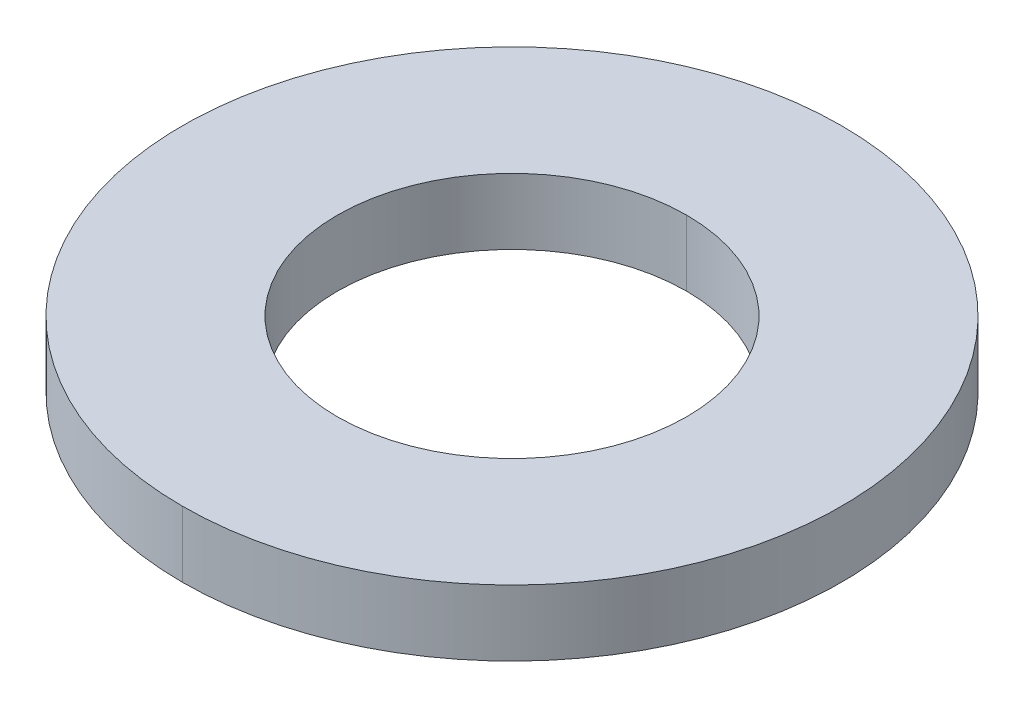
ISO-10303-21;
HEADER;
FILE_DESCRIPTION(('STEP AP214'),'2;1');
FILE_NAME('part.step','',(''),(''),'','','');
FILE_SCHEMA(('AUTOMOTIVE_DESIGN { 1 0 10303 214 1 1 1 1 }'));
ENDSEC;
DATA;
#1=APPLICATION_CONTEXT('core data for automotive mechanical design processes');
#2=APPLICATION_PROTOCOL_DEFINITION('international standard','automotive_design',2000,#1);
#3=PRODUCT_CONTEXT('',#1,'mechanical');
#4=PRODUCT('Part','Part','',(#3));
#5=PRODUCT_RELATED_PRODUCT_CATEGORY('part','',(#4));
#6=PRODUCT_DEFINITION_FORMATION('','',#4);
#7=PRODUCT_DEFINITION_CONTEXT('part definition',#1,'design');
#8=PRODUCT_DEFINITION('design','',#6,#7);
#9=PRODUCT_DEFINITION_SHAPE('','',#8);
#10=(LENGTH_UNIT() NAMED_UNIT(*) SI_UNIT(.MILLI.,.METRE.));
#11=(NAMED_UNIT(*) PLANE_ANGLE_UNIT() SI_UNIT($,.RADIAN.));
#12=(NAMED_UNIT(*) SI_UNIT($,.STERADIAN.) SOLID_ANGLE_UNIT());
#13=UNCERTAINTY_MEASURE_WITH_UNIT(LENGTH_MEASURE(1.E-05),#10,'distance_accuracy_value','');
#14=(GEOMETRIC_REPRESENTATION_CONTEXT(3) GLOBAL_UNCERTAINTY_ASSIGNED_CONTEXT((#13)) GLOBAL_UNIT_ASSIGNED_CONTEXT((#10,
#11,#12)) REPRESENTATION_CONTEXT('',''));
#15=CARTESIAN_POINT('',(0.,0.,0.));
#16=DIRECTION('',(0.,0.,1.));
#17=DIRECTION('',(1.,0.,0.));
#18=AXIS2_PLACEMENT_3D('',#15,#16,#17);
#19=CARTESIAN_POINT('',(0.,1.,0.));
#20=DIRECTION('',(0.,-1.,0.));
#21=DIRECTION('',(0.,0.,-1.));
#22=AXIS2_PLACEMENT_3D('',#19,#20,#21);
#23=CYLINDRICAL_SURFACE('',#22,2.65);
#24=DIRECTION('',(0.,-1.,0.));
#25=VECTOR('',#24,1.);
#26=CARTESIAN_POINT('',(0.,1.,2.65));
#27=LINE('',#26,#25);
#28=CARTESIAN_POINT('',(0.,1.,2.65));
#29=VERTEX_POINT('',#28);
#30=CARTESIAN_POINT('',(0.,0.,2.65));
#31=VERTEX_POINT('',#30);
#32=EDGE_CURVE('E125',#29,#31,#27,.T.);
#33=ORIENTED_EDGE('',*,*,#32,.F.);
#34=CARTESIAN_POINT('',(0.,1.,0.));
#35=DIRECTION('',(0.,1.,0.));
#36=DIRECTION('',(0.,0.,1.));
#37=AXIS2_PLACEMENT_3D('',#34,#35,#36);
#38=CIRCLE('',#37,2.65);
#39=CARTESIAN_POINT('',(0.,1.,-2.65));
#40=VERTEX_POINT('',#39);
#41=EDGE_CURVE('E76',#29,#40,#38,.T.);
#42=ORIENTED_EDGE('',*,*,#41,.T.);
#43=DIRECTION('',(0.,-1.,0.));
#44=VECTOR('',#43,1.);
#45=CARTESIAN_POINT('',(0.,1.,-2.65));
#46=LINE('',#45,#44);
#47=CARTESIAN_POINT('',(0.,0.,-2.65));
#48=VERTEX_POINT('',#47);
#49=EDGE_CURVE('E88',#40,#48,#46,.T.);
#50=ORIENTED_EDGE('',*,*,#49,.T.);
#51=CARTESIAN_POINT('',(0.,0.,0.));
#52=DIRECTION('',(0.,1.,0.));
#53=DIRECTION('',(0.,0.,1.));
#54=AXIS2_PLACEMENT_3D('',#51,#52,#53);
#55=CIRCLE('',#54,2.65);
#56=EDGE_CURVE('E11',#31,#48,#55,.T.);
#57=ORIENTED_EDGE('',*,*,#56,.F.);
#58=EDGE_LOOP('',(#33,#42,#50,#57));
#59=FACE_BOUND('',#58,.T.);
#60=ADVANCED_FACE('F17',(#59),#23,.F.);
#61=CARTESIAN_POINT('',(0.,1.,0.));
#62=DIRECTION('',(0.,-1.,0.));
#63=DIRECTION('',(0.,0.,-1.));
#64=AXIS2_PLACEMENT_3D('',#61,#62,#63);
#65=CYLINDRICAL_SURFACE('',#64,5.);
#66=DIRECTION('',(0.,-1.,0.));
#67=VECTOR('',#66,1.);
#68=CARTESIAN_POINT('',(0.,1.,5.));
#69=LINE('',#68,#67);
#70=CARTESIAN_POINT('',(0.,1.,5.));
#71=VERTEX_POINT('',#70);
#72=CARTESIAN_POINT('',(0.,0.,5.));
#73=VERTEX_POINT('',#72);
#74=EDGE_CURVE('E79',#71,#73,#69,.T.);
#75=ORIENTED_EDGE('',*,*,#74,.F.);
#76=CARTESIAN_POINT('',(0.,1.,0.));
#77=DIRECTION('',(0.,1.,0.));
#78=DIRECTION('',(0.,0.,1.));
#79=AXIS2_PLACEMENT_3D('',#76,#77,#78);
#80=CIRCLE('',#79,5.);
#81=CARTESIAN_POINT('',(0.,1.,-5.));
#82=VERTEX_POINT('',#81);
#83=EDGE_CURVE('E70',#82,#71,#80,.T.);
#84=ORIENTED_EDGE('',*,*,#83,.F.);
#85=DIRECTION('',(0.,-1.,0.));
#86=VECTOR('',#85,1.);
#87=CARTESIAN_POINT('',(0.,1.,-5.));
#88=LINE('',#87,#86);
#89=CARTESIAN_POINT('',(0.,0.,-5.));
#90=VERTEX_POINT('',#89);
#91=EDGE_CURVE('E77',#82,#90,#88,.T.);
#92=ORIENTED_EDGE('',*,*,#91,.T.);
#93=CARTESIAN_POINT('',(0.,0.,0.));
#94=DIRECTION('',(0.,1.,0.));
#95=DIRECTION('',(0.,0.,1.));
#96=AXIS2_PLACEMENT_3D('',#93,#94,#95);
#97=CIRCLE('',#96,5.);
#98=EDGE_CURVE('E25',#90,#73,#97,.T.);
#99=ORIENTED_EDGE('',*,*,#98,.T.);
#100=EDGE_LOOP('',(#75,#84,#92,#99));
#101=FACE_BOUND('',#100,.T.);
#102=ADVANCED_FACE('F80',(#101),#65,.T.);
#103=CARTESIAN_POINT('',(0.,0.,0.));
#104=DIRECTION('',(0.,1.,0.));
#105=DIRECTION('',(1.,0.,0.));
#106=AXIS2_PLACEMENT_3D('',#103,#104,#105);
#107=PLANE('',#106);
#108=CARTESIAN_POINT('',(0.,0.,0.));
#109=DIRECTION('',(0.,1.,0.));
#110=DIRECTION('',(0.,0.,1.));
#111=AXIS2_PLACEMENT_3D('',#108,#109,#110);
#112=CIRCLE('',#111,2.65);
#113=EDGE_CURVE('E95',#48,#31,#112,.T.);
#114=ORIENTED_EDGE('',*,*,#113,.T.);
#115=ORIENTED_EDGE('',*,*,#56,.T.);
#116=EDGE_LOOP('',(#114,#115));
#117=FACE_BOUND('',#116,.T.);
#118=ORIENTED_EDGE('',*,*,#98,.F.);
#119=CARTESIAN_POINT('',(0.,0.,0.));
#120=DIRECTION('',(0.,1.,0.));
#121=DIRECTION('',(0.,0.,1.));
#122=AXIS2_PLACEMENT_3D('',#119,#120,#121);
#123=CIRCLE('',#122,5.);
#124=EDGE_CURVE('E84',#73,#90,#123,.T.);
#125=ORIENTED_EDGE('',*,*,#124,.F.);
#126=EDGE_LOOP('',(#118,#125));
#127=FACE_BOUND('',#126,.T.);
#128=ADVANCED_FACE('F106',(#117,#127),#107,.F.);
#129=CARTESIAN_POINT('',(0.,1.,0.));
#130=DIRECTION('',(0.,1.,0.));
#131=DIRECTION('',(1.,0.,0.));
#132=AXIS2_PLACEMENT_3D('',#129,#130,#131);
#133=PLANE('',#132);
#134=CARTESIAN_POINT('',(0.,1.,0.));
#135=DIRECTION('',(0.,1.,0.));
#136=DIRECTION('',(0.,0.,1.));
#137=AXIS2_PLACEMENT_3D('',#134,#135,#136);
#138=CIRCLE('',#137,2.65);
#139=EDGE_CURVE('E131',#40,#29,#138,.T.);
#140=ORIENTED_EDGE('',*,*,#139,.F.);
#141=ORIENTED_EDGE('',*,*,#41,.F.);
#142=EDGE_LOOP('',(#140,#141));
#143=FACE_BOUND('',#142,.T.);
#144=ORIENTED_EDGE('',*,*,#83,.T.);
#145=CARTESIAN_POINT('',(0.,1.,0.));
#146=DIRECTION('',(0.,1.,0.));
#147=DIRECTION('',(0.,0.,1.));
#148=AXIS2_PLACEMENT_3D('',#145,#146,#147);
#149=CIRCLE('',#148,5.);
#150=EDGE_CURVE('E73',#71,#82,#149,.T.);
#151=ORIENTED_EDGE('',*,*,#150,.T.);
#152=EDGE_LOOP('',(#144,#151));
#153=FACE_BOUND('',#152,.T.);
#154=ADVANCED_FACE('F71',(#143,#153),#133,.T.);
#155=CARTESIAN_POINT('',(0.,1.,0.));
#156=DIRECTION('',(0.,-1.,0.));
#157=DIRECTION('',(0.,0.,-1.));
#158=AXIS2_PLACEMENT_3D('',#155,#156,#157);
#159=CYLINDRICAL_SURFACE('',#158,5.);
#160=ORIENTED_EDGE('',*,*,#150,.F.);
#161=ORIENTED_EDGE('',*,*,#74,.T.);
#162=ORIENTED_EDGE('',*,*,#124,.T.);
#163=ORIENTED_EDGE('',*,*,#91,.F.);
#164=EDGE_LOOP('',(#160,#161,#162,#163));
#165=FACE_BOUND('',#164,.T.);
#166=ADVANCED_FACE('F86',(#165),#159,.T.);
#167=CARTESIAN_POINT('',(0.,1.,0.));
#168=DIRECTION('',(0.,-1.,0.));
#169=DIRECTION('',(0.,0.,-1.));
#170=AXIS2_PLACEMENT_3D('',#167,#168,#169);
#171=CYLINDRICAL_SURFACE('',#170,2.65);
#172=ORIENTED_EDGE('',*,*,#139,.T.);
#173=ORIENTED_EDGE('',*,*,#32,.T.);
#174=ORIENTED_EDGE('',*,*,#113,.F.);
#175=ORIENTED_EDGE('',*,*,#49,.F.);
#176=EDGE_LOOP('',(#172,#173,#174,#175));
#177=FACE_BOUND('',#176,.T.);
#178=ADVANCED_FACE('F134',(#177),#171,.F.);
#179=CLOSED_SHELL('',(#60,#102,#128,#154,#166,#178));
#180=MANIFOLD_SOLID_BREP('B1',#179);
#181=ADVANCED_BREP_SHAPE_REPRESENTATION('',(#18,#180),#14);
#182=SHAPE_DEFINITION_REPRESENTATION(#9,#181);
ENDSEC;
END-ISO-10303-21;
